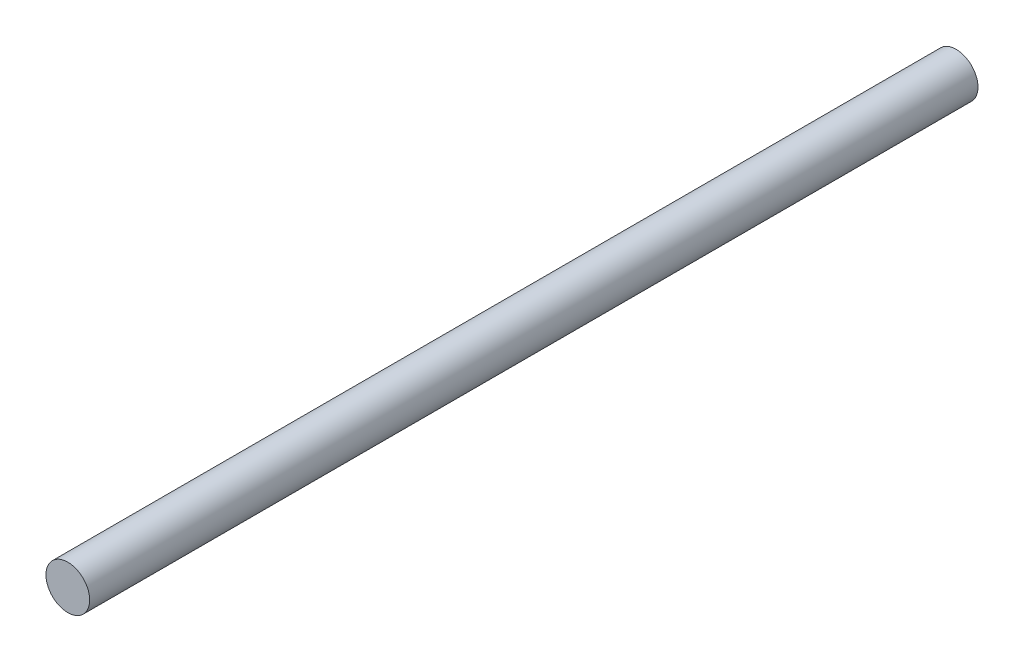
ISO-10303-21;
HEADER;
FILE_DESCRIPTION(('STEP AP214'),'2;1');
FILE_NAME('part.step','',(''),(''),'','','');
FILE_SCHEMA(('AUTOMOTIVE_DESIGN { 1 0 10303 214 1 1 1 1 }'));
ENDSEC;
DATA;
#1=APPLICATION_CONTEXT('core data for automotive mechanical design processes');
#2=APPLICATION_PROTOCOL_DEFINITION('international standard','automotive_design',2000,#1);
#3=PRODUCT_CONTEXT('',#1,'mechanical');
#4=PRODUCT('Part','Part','',(#3));
#5=PRODUCT_RELATED_PRODUCT_CATEGORY('part','',(#4));
#6=PRODUCT_DEFINITION_FORMATION('','',#4);
#7=PRODUCT_DEFINITION_CONTEXT('part definition',#1,'design');
#8=PRODUCT_DEFINITION('design','',#6,#7);
#9=PRODUCT_DEFINITION_SHAPE('','',#8);
#10=(LENGTH_UNIT() NAMED_UNIT(*) SI_UNIT(.MILLI.,.METRE.));
#11=(NAMED_UNIT(*) PLANE_ANGLE_UNIT() SI_UNIT($,.RADIAN.));
#12=(NAMED_UNIT(*) SI_UNIT($,.STERADIAN.) SOLID_ANGLE_UNIT());
#13=UNCERTAINTY_MEASURE_WITH_UNIT(LENGTH_MEASURE(1.E-05),#10,'distance_accuracy_value','');
#14=(GEOMETRIC_REPRESENTATION_CONTEXT(3) GLOBAL_UNCERTAINTY_ASSIGNED_CONTEXT((#13)) GLOBAL_UNIT_ASSIGNED_CONTEXT((#10,
#11,#12)) REPRESENTATION_CONTEXT('',''));
#15=CARTESIAN_POINT('',(0.,0.,0.));
#16=DIRECTION('',(0.,0.,1.));
#17=DIRECTION('',(1.,0.,0.));
#18=AXIS2_PLACEMENT_3D('',#15,#16,#17);
#19=CARTESIAN_POINT('',(0.,0.,162.5));
#20=DIRECTION('',(0.,0.,-1.));
#21=DIRECTION('',(-1.,0.,0.));
#22=AXIS2_PLACEMENT_3D('',#19,#20,#21);
#23=CYLINDRICAL_SURFACE('',#22,8.);
#24=CARTESIAN_POINT('',(0.,0.,162.5));
#25=DIRECTION('',(0.,0.,1.));
#26=DIRECTION('',(1.,0.,0.));
#27=AXIS2_PLACEMENT_3D('',#24,#25,#26);
#28=CIRCLE('',#27,8.);
#29=CARTESIAN_POINT('',(8.,0.,162.5));
#30=VERTEX_POINT('',#29);
#31=EDGE_CURVE('E10',#30,#30,#28,.T.);
#32=ORIENTED_EDGE('',*,*,#31,.F.);
#33=EDGE_LOOP('',(#32));
#34=FACE_BOUND('',#33,.T.);
#35=CARTESIAN_POINT('',(0.,0.,-162.5));
#36=DIRECTION('',(0.,0.,1.));
#37=DIRECTION('',(1.,0.,0.));
#38=AXIS2_PLACEMENT_3D('',#35,#36,#37);
#39=CIRCLE('',#38,8.);
#40=CARTESIAN_POINT('',(8.,0.,-162.5));
#41=VERTEX_POINT('',#40);
#42=EDGE_CURVE('E33',#41,#41,#39,.T.);
#43=ORIENTED_EDGE('',*,*,#42,.T.);
#44=EDGE_LOOP('',(#43));
#45=FACE_BOUND('',#44,.T.);
#46=ADVANCED_FACE('F30',(#34,#45),#23,.T.);
#47=CARTESIAN_POINT('',(0.,0.,162.5));
#48=DIRECTION('',(0.,0.,1.));
#49=DIRECTION('',(1.,0.,0.));
#50=AXIS2_PLACEMENT_3D('',#47,#48,#49);
#51=PLANE('',#50);
#52=ORIENTED_EDGE('',*,*,#31,.T.);
#53=EDGE_LOOP('',(#52));
#54=FACE_BOUND('',#53,.T.);
#55=ADVANCED_FACE('F45',(#54),#51,.T.);
#56=CARTESIAN_POINT('',(0.,0.,-162.5));
#57=DIRECTION('',(0.,0.,1.));
#58=DIRECTION('',(1.,0.,0.));
#59=AXIS2_PLACEMENT_3D('',#56,#57,#58);
#60=PLANE('',#59);
#61=ORIENTED_EDGE('',*,*,#42,.F.);
#62=EDGE_LOOP('',(#61));
#63=FACE_BOUND('',#62,.T.);
#64=ADVANCED_FACE('F43',(#63),#60,.F.);
#65=CLOSED_SHELL('',(#46,#55,#64));
#66=MANIFOLD_SOLID_BREP('B2',#65);
#67=ADVANCED_BREP_SHAPE_REPRESENTATION('',(#18,#66),#14);
#68=SHAPE_DEFINITION_REPRESENTATION(#9,#67);
ENDSEC;
END-ISO-10303-21;
